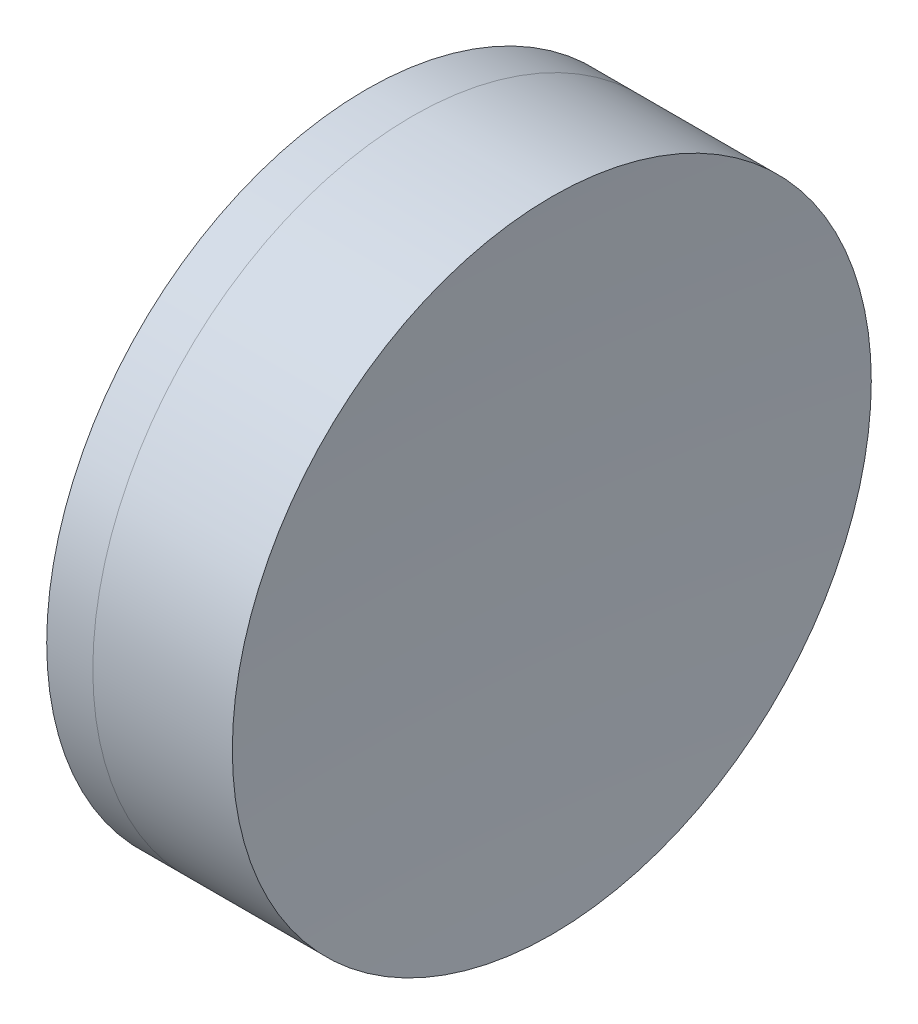
ISO-10303-21;
HEADER;
FILE_DESCRIPTION(('STEP AP214'),'2;1');
FILE_NAME('part.step','',(''),(''),'','','');
FILE_SCHEMA(('AUTOMOTIVE_DESIGN { 1 0 10303 214 1 1 1 1 }'));
ENDSEC;
DATA;
#1=APPLICATION_CONTEXT('core data for automotive mechanical design processes');
#2=APPLICATION_PROTOCOL_DEFINITION('international standard','automotive_design',2000,#1);
#3=PRODUCT_CONTEXT('',#1,'mechanical');
#4=PRODUCT('Part','Part','',(#3));
#5=PRODUCT_RELATED_PRODUCT_CATEGORY('part','',(#4));
#6=PRODUCT_DEFINITION_FORMATION('','',#4);
#7=PRODUCT_DEFINITION_CONTEXT('part definition',#1,'design');
#8=PRODUCT_DEFINITION('design','',#6,#7);
#9=PRODUCT_DEFINITION_SHAPE('','',#8);
#10=(LENGTH_UNIT() NAMED_UNIT(*) SI_UNIT(.MILLI.,.METRE.));
#11=(NAMED_UNIT(*) PLANE_ANGLE_UNIT() SI_UNIT($,.RADIAN.));
#12=(NAMED_UNIT(*) SI_UNIT($,.STERADIAN.) SOLID_ANGLE_UNIT());
#13=UNCERTAINTY_MEASURE_WITH_UNIT(LENGTH_MEASURE(1.E-05),#10,'distance_accuracy_value','');
#14=(GEOMETRIC_REPRESENTATION_CONTEXT(3) GLOBAL_UNCERTAINTY_ASSIGNED_CONTEXT((#13)) GLOBAL_UNIT_ASSIGNED_CONTEXT((#10,
#11,#12)) REPRESENTATION_CONTEXT('',''));
#15=CARTESIAN_POINT('',(0.,0.,0.));
#16=DIRECTION('',(0.,0.,1.));
#17=DIRECTION('',(1.,0.,0.));
#18=AXIS2_PLACEMENT_3D('',#15,#16,#17);
#19=CARTESIAN_POINT('',(15.079373797211,0.,0.));
#20=DIRECTION('',(-1.,0.,0.));
#21=DIRECTION('',(0.,0.,1.));
#22=AXIS2_PLACEMENT_3D('',#19,#20,#21);
#23=SPHERICAL_SURFACE('',#22,25.88);
#24=CARTESIAN_POINT('',(37.6289724632627,0.,0.));
#25=DIRECTION('',(-1.,0.,0.));
#26=DIRECTION('',(0.,0.,1.));
#27=AXIS2_PLACEMENT_3D('',#24,#25,#26);
#28=CIRCLE('',#27,12.7);
#29=CARTESIAN_POINT('',(37.6289724632627,0.,12.7));
#30=VERTEX_POINT('',#29);
#31=EDGE_CURVE('E51',#30,#30,#28,.T.);
#32=ORIENTED_EDGE('',*,*,#31,.T.);
#33=EDGE_LOOP('',(#32));
#34=FACE_BOUND('',#33,.T.);
#35=ADVANCED_FACE('F45',(#34),#23,.F.);
#36=CARTESIAN_POINT('',(237.299373797211,0.,0.));
#37=DIRECTION('',(-1.,0.,0.));
#38=DIRECTION('',(0.,0.,-1.));
#39=AXIS2_PLACEMENT_3D('',#36,#37,#38);
#40=SPHERICAL_SURFACE('',#39,194.54);
#41=CARTESIAN_POINT('',(43.1743584076429,0.,0.));
#42=DIRECTION('',(-1.,0.,0.));
#43=DIRECTION('',(0.,0.,1.));
#44=AXIS2_PLACEMENT_3D('',#41,#42,#43);
#45=CIRCLE('',#44,12.7);
#46=CARTESIAN_POINT('',(43.1743584076429,0.,12.7));
#47=VERTEX_POINT('',#46);
#48=EDGE_CURVE('E11',#47,#47,#45,.T.);
#49=ORIENTED_EDGE('',*,*,#48,.F.);
#50=EDGE_LOOP('',(#49));
#51=FACE_BOUND('',#50,.T.);
#52=ADVANCED_FACE('F60',(#51),#40,.F.);
#53=CARTESIAN_POINT('',(-0.551919992657797,0.,0.));
#54=DIRECTION('',(-1.,0.,0.));
#55=DIRECTION('',(0.,0.,1.));
#56=AXIS2_PLACEMENT_3D('',#53,#54,#55);
#57=CYLINDRICAL_SURFACE('',#56,12.7);
#58=ORIENTED_EDGE('',*,*,#48,.T.);
#59=EDGE_LOOP('',(#58));
#60=FACE_BOUND('',#59,.T.);
#61=ORIENTED_EDGE('',*,*,#31,.F.);
#62=EDGE_LOOP('',(#61));
#63=FACE_BOUND('',#62,.T.);
#64=ADVANCED_FACE('F58',(#60,#63),#57,.T.);
#65=CLOSED_SHELL('',(#35,#52,#64));
#66=MANIFOLD_SOLID_BREP('B2',#65);
#67=CARTESIAN_POINT('',(54.899373797211,0.,0.));
#68=DIRECTION('',(-1.,0.,0.));
#69=DIRECTION('',(0.,0.,1.));
#70=AXIS2_PLACEMENT_3D('',#67,#68,#69);
#71=SPHERICAL_SURFACE('',#70,22.94);
#72=CARTESIAN_POINT('',(35.7956150047639,0.,0.));
#73=DIRECTION('',(-1.,0.,0.));
#74=DIRECTION('',(0.,0.,1.));
#75=AXIS2_PLACEMENT_3D('',#72,#73,#74);
#76=CIRCLE('',#75,12.7);
#77=CARTESIAN_POINT('',(35.7956150047639,0.,12.7));
#78=VERTEX_POINT('',#77);
#79=EDGE_CURVE('E44',#78,#78,#76,.T.);
#80=ORIENTED_EDGE('',*,*,#79,.T.);
#81=EDGE_LOOP('',(#80));
#82=FACE_BOUND('',#81,.T.);
#83=ADVANCED_FACE('F86',(#82),#71,.T.);
#84=CARTESIAN_POINT('',(-0.816062176165804,0.,0.));
#85=DIRECTION('',(-1.,0.,0.));
#86=DIRECTION('',(0.,0.,1.));
#87=AXIS2_PLACEMENT_3D('',#84,#85,#86);
#88=CYLINDRICAL_SURFACE('',#87,12.7);
#89=CARTESIAN_POINT('',(37.6289724632627,0.,0.));
#90=DIRECTION('',(-1.,0.,0.));
#91=DIRECTION('',(0.,0.,1.));
#92=AXIS2_PLACEMENT_3D('',#89,#90,#91);
#93=CIRCLE('',#92,12.7);
#94=CARTESIAN_POINT('',(37.6289724632627,0.,12.7));
#95=VERTEX_POINT('',#94);
#96=EDGE_CURVE('E92',#95,#95,#93,.T.);
#97=ORIENTED_EDGE('',*,*,#96,.T.);
#98=EDGE_LOOP('',(#97));
#99=FACE_BOUND('',#98,.T.);
#100=ORIENTED_EDGE('',*,*,#79,.F.);
#101=EDGE_LOOP('',(#100));
#102=FACE_BOUND('',#101,.T.);
#103=ADVANCED_FACE('F98',(#99,#102),#88,.T.);
#104=CARTESIAN_POINT('',(15.079373797211,0.,0.));
#105=DIRECTION('',(-1.,0.,0.));
#106=DIRECTION('',(0.,0.,1.));
#107=AXIS2_PLACEMENT_3D('',#104,#105,#106);
#108=SPHERICAL_SURFACE('',#107,25.88);
#109=ORIENTED_EDGE('',*,*,#96,.F.);
#110=EDGE_LOOP('',(#109));
#111=FACE_BOUND('',#110,.T.);
#112=ADVANCED_FACE('F101',(#111),#108,.T.);
#113=CLOSED_SHELL('',(#83,#103,#112));
#114=MANIFOLD_SOLID_BREP('B6',#113);
#115=ADVANCED_BREP_SHAPE_REPRESENTATION('',(#18,#66,#114),#14);
#116=SHAPE_DEFINITION_REPRESENTATION(#9,#115);
ENDSEC;
END-ISO-10303-21;
